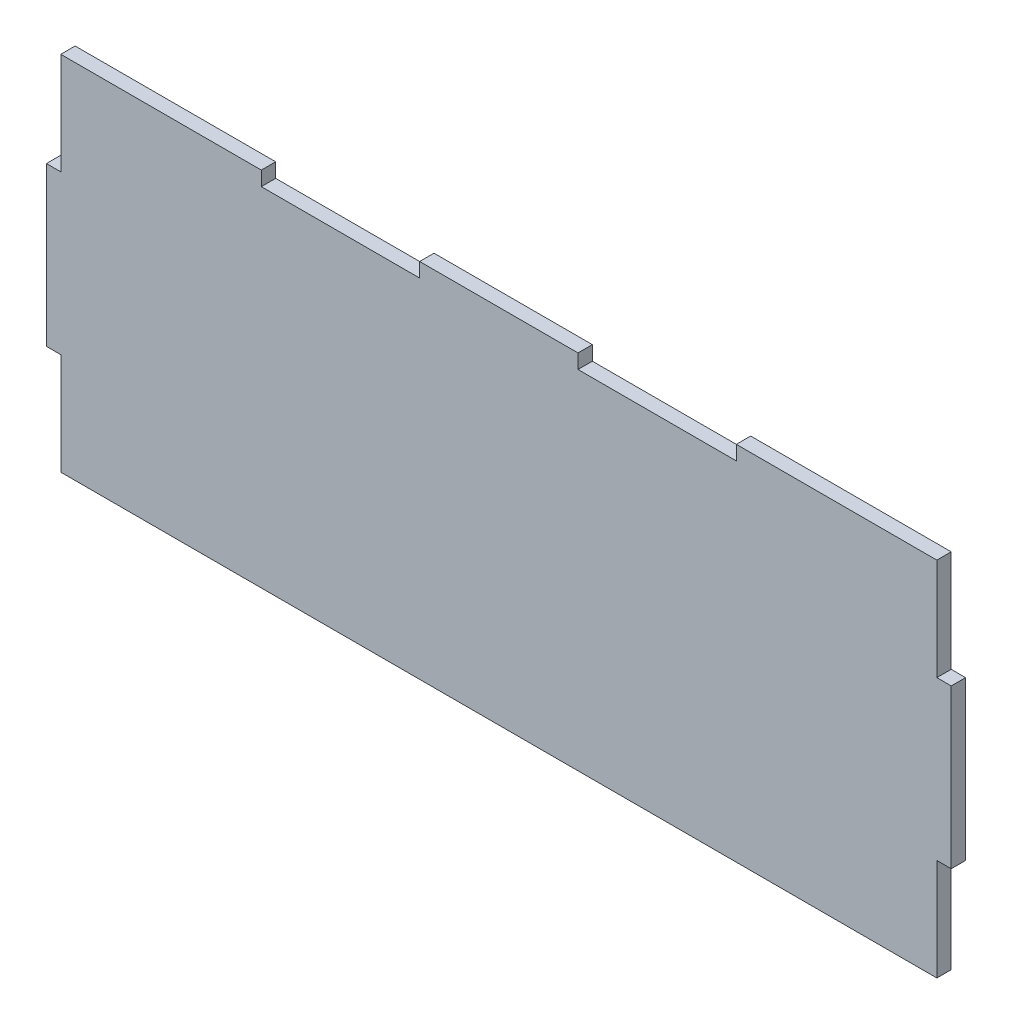
ISO-10303-21;
HEADER;
FILE_DESCRIPTION(('STEP AP214'),'2;1');
FILE_NAME('part.step','',(''),(''),'','','');
FILE_SCHEMA(('AUTOMOTIVE_DESIGN { 1 0 10303 214 1 1 1 1 }'));
ENDSEC;
DATA;
#1=APPLICATION_CONTEXT('core data for automotive mechanical design processes');
#2=APPLICATION_PROTOCOL_DEFINITION('international standard','automotive_design',2000,#1);
#3=PRODUCT_CONTEXT('',#1,'mechanical');
#4=PRODUCT('Part','Part','',(#3));
#5=PRODUCT_RELATED_PRODUCT_CATEGORY('part','',(#4));
#6=PRODUCT_DEFINITION_FORMATION('','',#4);
#7=PRODUCT_DEFINITION_CONTEXT('part definition',#1,'design');
#8=PRODUCT_DEFINITION('design','',#6,#7);
#9=PRODUCT_DEFINITION_SHAPE('','',#8);
#10=(LENGTH_UNIT() NAMED_UNIT(*) SI_UNIT(.MILLI.,.METRE.));
#11=(NAMED_UNIT(*) PLANE_ANGLE_UNIT() SI_UNIT($,.RADIAN.));
#12=(NAMED_UNIT(*) SI_UNIT($,.STERADIAN.) SOLID_ANGLE_UNIT());
#13=UNCERTAINTY_MEASURE_WITH_UNIT(LENGTH_MEASURE(1.E-05),#10,'distance_accuracy_value','');
#14=(GEOMETRIC_REPRESENTATION_CONTEXT(3) GLOBAL_UNCERTAINTY_ASSIGNED_CONTEXT((#13)) GLOBAL_UNIT_ASSIGNED_CONTEXT((#10,
#11,#12)) REPRESENTATION_CONTEXT('',''));
#15=CARTESIAN_POINT('',(0.,0.,0.));
#16=DIRECTION('',(0.,0.,1.));
#17=DIRECTION('',(1.,0.,0.));
#18=AXIS2_PLACEMENT_3D('',#15,#16,#17);
#19=CARTESIAN_POINT('',(-100.,40.,3.175));
#20=DIRECTION('',(0.,-1.,0.));
#21=DIRECTION('',(0.,0.,-1.));
#22=AXIS2_PLACEMENT_3D('',#19,#20,#21);
#23=PLANE('',#22);
#24=DIRECTION('',(0.,0.,1.));
#25=VECTOR('',#24,1.);
#26=CARTESIAN_POINT('',(96.825,40.,0.));
#27=LINE('',#26,#25);
#28=CARTESIAN_POINT('',(96.825,40.,0.));
#29=VERTEX_POINT('',#28);
#30=CARTESIAN_POINT('',(96.825,40.,3.175));
#31=VERTEX_POINT('',#30);
#32=EDGE_CURVE('E176',#29,#31,#27,.T.);
#33=ORIENTED_EDGE('',*,*,#32,.F.);
#34=DIRECTION('',(-1.,0.,0.));
#35=VECTOR('',#34,1.);
#36=CARTESIAN_POINT('',(-100.,40.,0.));
#37=LINE('',#36,#35);
#38=CARTESIAN_POINT('',(52.5,40.,0.));
#39=VERTEX_POINT('',#38);
#40=EDGE_CURVE('E40',#29,#39,#37,.T.);
#41=ORIENTED_EDGE('',*,*,#40,.T.);
#42=DIRECTION('',(0.,0.,1.));
#43=VECTOR('',#42,1.);
#44=CARTESIAN_POINT('',(52.5,40.,0.));
#45=LINE('',#44,#43);
#46=CARTESIAN_POINT('',(52.5,40.,3.175));
#47=VERTEX_POINT('',#46);
#48=EDGE_CURVE('E256',#39,#47,#45,.T.);
#49=ORIENTED_EDGE('',*,*,#48,.T.);
#50=DIRECTION('',(-1.,0.,0.));
#51=VECTOR('',#50,1.);
#52=CARTESIAN_POINT('',(-100.,40.,3.175));
#53=LINE('',#52,#51);
#54=EDGE_CURVE('E11',#31,#47,#53,.T.);
#55=ORIENTED_EDGE('',*,*,#54,.F.);
#56=EDGE_LOOP('',(#33,#41,#49,#55));
#57=FACE_BOUND('',#56,.T.);
#58=ADVANCED_FACE('F36',(#57),#23,.F.);
#59=CARTESIAN_POINT('',(-100.,-40.,3.175));
#60=DIRECTION('',(0.,1.,0.));
#61=DIRECTION('',(-1.,0.,0.));
#62=AXIS2_PLACEMENT_3D('',#59,#60,#61);
#63=PLANE('',#62);
#64=DIRECTION('',(0.,0.,1.));
#65=VECTOR('',#64,1.);
#66=CARTESIAN_POINT('',(96.825,-40.,0.));
#67=LINE('',#66,#65);
#68=CARTESIAN_POINT('',(96.825,-40.,0.));
#69=VERTEX_POINT('',#68);
#70=CARTESIAN_POINT('',(96.825,-40.,3.175));
#71=VERTEX_POINT('',#70);
#72=EDGE_CURVE('E312',#69,#71,#67,.T.);
#73=ORIENTED_EDGE('',*,*,#72,.T.);
#74=DIRECTION('',(1.,0.,0.));
#75=VECTOR('',#74,1.);
#76=CARTESIAN_POINT('',(-100.,-40.,3.175));
#77=LINE('',#76,#75);
#78=CARTESIAN_POINT('',(-96.825,-40.,3.175));
#79=VERTEX_POINT('',#78);
#80=EDGE_CURVE('E197',#79,#71,#77,.T.);
#81=ORIENTED_EDGE('',*,*,#80,.F.);
#82=DIRECTION('',(0.,0.,1.));
#83=VECTOR('',#82,1.);
#84=CARTESIAN_POINT('',(-96.825,-40.,0.));
#85=LINE('',#84,#83);
#86=CARTESIAN_POINT('',(-96.825,-40.,0.));
#87=VERTEX_POINT('',#86);
#88=EDGE_CURVE('E273',#87,#79,#85,.T.);
#89=ORIENTED_EDGE('',*,*,#88,.F.);
#90=DIRECTION('',(1.,0.,0.));
#91=VECTOR('',#90,1.);
#92=CARTESIAN_POINT('',(-100.,-40.,0.));
#93=LINE('',#92,#91);
#94=EDGE_CURVE('E207',#87,#69,#93,.T.);
#95=ORIENTED_EDGE('',*,*,#94,.T.);
#96=EDGE_LOOP('',(#73,#81,#89,#95));
#97=FACE_BOUND('',#96,.T.);
#98=ADVANCED_FACE('F345',(#97),#63,.F.);
#99=CARTESIAN_POINT('',(100.,40.,3.175));
#100=DIRECTION('',(-1.,0.,0.));
#101=DIRECTION('',(0.,0.,1.));
#102=AXIS2_PLACEMENT_3D('',#99,#100,#101);
#103=PLANE('',#102);
#104=DIRECTION('',(0.,0.,1.));
#105=VECTOR('',#104,1.);
#106=CARTESIAN_POINT('',(100.,17.5,0.));
#107=LINE('',#106,#105);
#108=CARTESIAN_POINT('',(100.,17.5,0.));
#109=VERTEX_POINT('',#108);
#110=CARTESIAN_POINT('',(100.,17.5,3.175));
#111=VERTEX_POINT('',#110);
#112=EDGE_CURVE('E288',#109,#111,#107,.T.);
#113=ORIENTED_EDGE('',*,*,#112,.T.);
#114=DIRECTION('',(0.,1.,0.));
#115=VECTOR('',#114,1.);
#116=CARTESIAN_POINT('',(100.,40.,3.175));
#117=LINE('',#116,#115);
#118=CARTESIAN_POINT('',(100.,-17.5,3.175));
#119=VERTEX_POINT('',#118);
#120=EDGE_CURVE('E219',#119,#111,#117,.T.);
#121=ORIENTED_EDGE('',*,*,#120,.F.);
#122=DIRECTION('',(0.,0.,1.));
#123=VECTOR('',#122,1.);
#124=CARTESIAN_POINT('',(100.,-17.5,0.));
#125=LINE('',#124,#123);
#126=CARTESIAN_POINT('',(100.,-17.5,0.));
#127=VERTEX_POINT('',#126);
#128=EDGE_CURVE('E308',#127,#119,#125,.T.);
#129=ORIENTED_EDGE('',*,*,#128,.F.);
#130=DIRECTION('',(0.,1.,0.));
#131=VECTOR('',#130,1.);
#132=CARTESIAN_POINT('',(100.,40.,0.));
#133=LINE('',#132,#131);
#134=EDGE_CURVE('E201',#127,#109,#133,.T.);
#135=ORIENTED_EDGE('',*,*,#134,.T.);
#136=EDGE_LOOP('',(#113,#121,#129,#135));
#137=FACE_BOUND('',#136,.T.);
#138=ADVANCED_FACE('F337',(#137),#103,.F.);
#139=CARTESIAN_POINT('',(0.,0.,3.175));
#140=DIRECTION('',(0.,0.,1.));
#141=DIRECTION('',(1.,0.,0.));
#142=AXIS2_PLACEMENT_3D('',#139,#140,#141);
#143=PLANE('',#142);
#144=ORIENTED_EDGE('',*,*,#120,.T.);
#145=DIRECTION('',(-1.,0.,0.));
#146=VECTOR('',#145,1.);
#147=CARTESIAN_POINT('',(100.,17.5,3.175));
#148=LINE('',#147,#146);
#149=CARTESIAN_POINT('',(96.825,17.5,3.175));
#150=VERTEX_POINT('',#149);
#151=EDGE_CURVE('E182',#111,#150,#148,.T.);
#152=ORIENTED_EDGE('',*,*,#151,.T.);
#153=DIRECTION('',(0.,1.,0.));
#154=VECTOR('',#153,1.);
#155=CARTESIAN_POINT('',(96.825,40.,3.175));
#156=LINE('',#155,#154);
#157=EDGE_CURVE('E315',#150,#31,#156,.T.);
#158=ORIENTED_EDGE('',*,*,#157,.T.);
#159=ORIENTED_EDGE('',*,*,#54,.T.);
#160=DIRECTION('',(0.,1.,0.));
#161=VECTOR('',#160,1.);
#162=CARTESIAN_POINT('',(52.5,40.,3.175));
#163=LINE('',#162,#161);
#164=CARTESIAN_POINT('',(52.5,36.825,3.175));
#165=VERTEX_POINT('',#164);
#166=EDGE_CURVE('E259',#165,#47,#163,.T.);
#167=ORIENTED_EDGE('',*,*,#166,.F.);
#168=DIRECTION('',(1.,0.,0.));
#169=VECTOR('',#168,1.);
#170=CARTESIAN_POINT('',(17.5,36.825,3.175));
#171=LINE('',#170,#169);
#172=CARTESIAN_POINT('',(17.5,36.825,3.175));
#173=VERTEX_POINT('',#172);
#174=EDGE_CURVE('E263',#173,#165,#171,.T.);
#175=ORIENTED_EDGE('',*,*,#174,.F.);
#176=DIRECTION('',(0.,-1.,0.));
#177=VECTOR('',#176,1.);
#178=CARTESIAN_POINT('',(17.5,40.,3.175));
#179=LINE('',#178,#177);
#180=CARTESIAN_POINT('',(17.5,40.,3.175));
#181=VERTEX_POINT('',#180);
#182=EDGE_CURVE('E234',#181,#173,#179,.T.);
#183=ORIENTED_EDGE('',*,*,#182,.F.);
#184=CARTESIAN_POINT('',(-17.5,40.,3.175));
#185=VERTEX_POINT('',#184);
#186=EDGE_CURVE('E45',#181,#185,#53,.T.);
#187=ORIENTED_EDGE('',*,*,#186,.T.);
#188=DIRECTION('',(0.,1.,0.));
#189=VECTOR('',#188,1.);
#190=CARTESIAN_POINT('',(-17.5,40.,3.175));
#191=LINE('',#190,#189);
#192=CARTESIAN_POINT('',(-17.5,36.825,3.175));
#193=VERTEX_POINT('',#192);
#194=EDGE_CURVE('E242',#193,#185,#191,.T.);
#195=ORIENTED_EDGE('',*,*,#194,.F.);
#196=DIRECTION('',(1.,0.,0.));
#197=VECTOR('',#196,1.);
#198=CARTESIAN_POINT('',(-17.5,36.825,3.175));
#199=LINE('',#198,#197);
#200=CARTESIAN_POINT('',(-52.5,36.825,3.175));
#201=VERTEX_POINT('',#200);
#202=EDGE_CURVE('E235',#201,#193,#199,.T.);
#203=ORIENTED_EDGE('',*,*,#202,.F.);
#204=DIRECTION('',(0.,-1.,0.));
#205=VECTOR('',#204,1.);
#206=CARTESIAN_POINT('',(-52.5,40.,3.175));
#207=LINE('',#206,#205);
#208=CARTESIAN_POINT('',(-52.5,40.,3.175));
#209=VERTEX_POINT('',#208);
#210=EDGE_CURVE('E239',#209,#201,#207,.T.);
#211=ORIENTED_EDGE('',*,*,#210,.F.);
#212=CARTESIAN_POINT('',(-96.825,40.,3.175));
#213=VERTEX_POINT('',#212);
#214=EDGE_CURVE('E47',#209,#213,#53,.T.);
#215=ORIENTED_EDGE('',*,*,#214,.T.);
#216=DIRECTION('',(0.,1.,0.));
#217=VECTOR('',#216,1.);
#218=CARTESIAN_POINT('',(-96.825,40.,3.175));
#219=LINE('',#218,#217);
#220=CARTESIAN_POINT('',(-96.825,17.5,3.175));
#221=VERTEX_POINT('',#220);
#222=EDGE_CURVE('E299',#221,#213,#219,.T.);
#223=ORIENTED_EDGE('',*,*,#222,.F.);
#224=DIRECTION('',(1.,0.,0.));
#225=VECTOR('',#224,1.);
#226=CARTESIAN_POINT('',(-100.,17.5,3.175));
#227=LINE('',#226,#225);
#228=CARTESIAN_POINT('',(-100.,17.5,3.175));
#229=VERTEX_POINT('',#228);
#230=EDGE_CURVE('E281',#229,#221,#227,.T.);
#231=ORIENTED_EDGE('',*,*,#230,.F.);
#232=DIRECTION('',(0.,-1.,0.));
#233=VECTOR('',#232,1.);
#234=CARTESIAN_POINT('',(-100.,40.,3.175));
#235=LINE('',#234,#233);
#236=CARTESIAN_POINT('',(-100.,-17.5,3.175));
#237=VERTEX_POINT('',#236);
#238=EDGE_CURVE('E193',#229,#237,#235,.T.);
#239=ORIENTED_EDGE('',*,*,#238,.T.);
#240=DIRECTION('',(-1.,0.,0.));
#241=VECTOR('',#240,1.);
#242=CARTESIAN_POINT('',(-100.,-17.5,3.175));
#243=LINE('',#242,#241);
#244=CARTESIAN_POINT('',(-96.825,-17.5,3.175));
#245=VERTEX_POINT('',#244);
#246=EDGE_CURVE('E282',#245,#237,#243,.T.);
#247=ORIENTED_EDGE('',*,*,#246,.F.);
#248=DIRECTION('',(0.,1.,0.));
#249=VECTOR('',#248,1.);
#250=CARTESIAN_POINT('',(-96.825,-40.,3.175));
#251=LINE('',#250,#249);
#252=EDGE_CURVE('E285',#79,#245,#251,.T.);
#253=ORIENTED_EDGE('',*,*,#252,.F.);
#254=ORIENTED_EDGE('',*,*,#80,.T.);
#255=DIRECTION('',(0.,1.,0.));
#256=VECTOR('',#255,1.);
#257=CARTESIAN_POINT('',(96.825,-40.,3.175));
#258=LINE('',#257,#256);
#259=CARTESIAN_POINT('',(96.825,-17.5,3.175));
#260=VERTEX_POINT('',#259);
#261=EDGE_CURVE('E316',#71,#260,#258,.T.);
#262=ORIENTED_EDGE('',*,*,#261,.T.);
#263=DIRECTION('',(1.,0.,0.));
#264=VECTOR('',#263,1.);
#265=CARTESIAN_POINT('',(100.,-17.5,3.175));
#266=LINE('',#265,#264);
#267=EDGE_CURVE('E320',#260,#119,#266,.T.);
#268=ORIENTED_EDGE('',*,*,#267,.T.);
#269=EDGE_LOOP('',(#144,#152,#158,#159,#167,#175,#183,#187,#195,#203,#211,#215,#223,#231,#239,
#247,#253,#254,#262,#268));
#270=FACE_BOUND('',#269,.T.);
#271=ADVANCED_FACE('F339',(#270),#143,.T.);
#272=CARTESIAN_POINT('',(0.,0.,0.));
#273=DIRECTION('',(0.,0.,1.));
#274=DIRECTION('',(1.,0.,0.));
#275=AXIS2_PLACEMENT_3D('',#272,#273,#274);
#276=PLANE('',#275);
#277=DIRECTION('',(-1.,0.,0.));
#278=VECTOR('',#277,1.);
#279=CARTESIAN_POINT('',(100.,17.5,0.));
#280=LINE('',#279,#278);
#281=CARTESIAN_POINT('',(96.825,17.5,0.));
#282=VERTEX_POINT('',#281);
#283=EDGE_CURVE('E181',#109,#282,#280,.T.);
#284=ORIENTED_EDGE('',*,*,#283,.F.);
#285=ORIENTED_EDGE('',*,*,#134,.F.);
#286=DIRECTION('',(1.,0.,0.));
#287=VECTOR('',#286,1.);
#288=CARTESIAN_POINT('',(100.,-17.5,0.));
#289=LINE('',#288,#287);
#290=CARTESIAN_POINT('',(96.825,-17.5,0.));
#291=VERTEX_POINT('',#290);
#292=EDGE_CURVE('E319',#291,#127,#289,.T.);
#293=ORIENTED_EDGE('',*,*,#292,.F.);
#294=DIRECTION('',(0.,1.,0.));
#295=VECTOR('',#294,1.);
#296=CARTESIAN_POINT('',(96.825,-40.,0.));
#297=LINE('',#296,#295);
#298=EDGE_CURVE('E310',#69,#291,#297,.T.);
#299=ORIENTED_EDGE('',*,*,#298,.F.);
#300=ORIENTED_EDGE('',*,*,#94,.F.);
#301=DIRECTION('',(0.,1.,0.));
#302=VECTOR('',#301,1.);
#303=CARTESIAN_POINT('',(-96.825,-40.,0.));
#304=LINE('',#303,#302);
#305=CARTESIAN_POINT('',(-96.825,-17.5,0.));
#306=VERTEX_POINT('',#305);
#307=EDGE_CURVE('E284',#87,#306,#304,.T.);
#308=ORIENTED_EDGE('',*,*,#307,.T.);
#309=DIRECTION('',(-1.,0.,0.));
#310=VECTOR('',#309,1.);
#311=CARTESIAN_POINT('',(-100.,-17.5,0.));
#312=LINE('',#311,#310);
#313=CARTESIAN_POINT('',(-100.,-17.5,0.));
#314=VERTEX_POINT('',#313);
#315=EDGE_CURVE('E276',#306,#314,#312,.T.);
#316=ORIENTED_EDGE('',*,*,#315,.T.);
#317=DIRECTION('',(0.,-1.,0.));
#318=VECTOR('',#317,1.);
#319=CARTESIAN_POINT('',(-100.,40.,0.));
#320=LINE('',#319,#318);
#321=CARTESIAN_POINT('',(-100.,17.5,0.));
#322=VERTEX_POINT('',#321);
#323=EDGE_CURVE('E213',#322,#314,#320,.T.);
#324=ORIENTED_EDGE('',*,*,#323,.F.);
#325=DIRECTION('',(1.,0.,0.));
#326=VECTOR('',#325,1.);
#327=CARTESIAN_POINT('',(-100.,17.5,0.));
#328=LINE('',#327,#326);
#329=CARTESIAN_POINT('',(-96.825,17.5,0.));
#330=VERTEX_POINT('',#329);
#331=EDGE_CURVE('E301',#322,#330,#328,.T.);
#332=ORIENTED_EDGE('',*,*,#331,.T.);
#333=DIRECTION('',(0.,1.,0.));
#334=VECTOR('',#333,1.);
#335=CARTESIAN_POINT('',(-96.825,40.,0.));
#336=LINE('',#335,#334);
#337=CARTESIAN_POINT('',(-96.825,40.,0.));
#338=VERTEX_POINT('',#337);
#339=EDGE_CURVE('E296',#330,#338,#336,.T.);
#340=ORIENTED_EDGE('',*,*,#339,.T.);
#341=CARTESIAN_POINT('',(-52.5,40.,0.));
#342=VERTEX_POINT('',#341);
#343=EDGE_CURVE('E195',#342,#338,#37,.T.);
#344=ORIENTED_EDGE('',*,*,#343,.F.);
#345=DIRECTION('',(0.,-1.,0.));
#346=VECTOR('',#345,1.);
#347=CARTESIAN_POINT('',(-52.5,40.,0.));
#348=LINE('',#347,#346);
#349=CARTESIAN_POINT('',(-52.5,36.825,0.));
#350=VERTEX_POINT('',#349);
#351=EDGE_CURVE('E247',#342,#350,#348,.T.);
#352=ORIENTED_EDGE('',*,*,#351,.T.);
#353=DIRECTION('',(1.,0.,0.));
#354=VECTOR('',#353,1.);
#355=CARTESIAN_POINT('',(-17.5,36.825,0.));
#356=LINE('',#355,#354);
#357=CARTESIAN_POINT('',(-17.5,36.825,0.));
#358=VERTEX_POINT('',#357);
#359=EDGE_CURVE('E228',#350,#358,#356,.T.);
#360=ORIENTED_EDGE('',*,*,#359,.T.);
#361=DIRECTION('',(0.,1.,0.));
#362=VECTOR('',#361,1.);
#363=CARTESIAN_POINT('',(-17.5,40.,0.));
#364=LINE('',#363,#362);
#365=CARTESIAN_POINT('',(-17.5,40.,0.));
#366=VERTEX_POINT('',#365);
#367=EDGE_CURVE('E238',#358,#366,#364,.T.);
#368=ORIENTED_EDGE('',*,*,#367,.T.);
#369=CARTESIAN_POINT('',(17.5,40.,0.));
#370=VERTEX_POINT('',#369);
#371=EDGE_CURVE('E194',#370,#366,#37,.T.);
#372=ORIENTED_EDGE('',*,*,#371,.F.);
#373=DIRECTION('',(0.,-1.,0.));
#374=VECTOR('',#373,1.);
#375=CARTESIAN_POINT('',(17.5,40.,0.));
#376=LINE('',#375,#374);
#377=CARTESIAN_POINT('',(17.5,36.825,0.));
#378=VERTEX_POINT('',#377);
#379=EDGE_CURVE('E262',#370,#378,#376,.T.);
#380=ORIENTED_EDGE('',*,*,#379,.T.);
#381=DIRECTION('',(1.,0.,0.));
#382=VECTOR('',#381,1.);
#383=CARTESIAN_POINT('',(17.5,36.825,0.));
#384=LINE('',#383,#382);
#385=CARTESIAN_POINT('',(52.5,36.825,0.));
#386=VERTEX_POINT('',#385);
#387=EDGE_CURVE('E269',#378,#386,#384,.T.);
#388=ORIENTED_EDGE('',*,*,#387,.T.);
#389=DIRECTION('',(0.,1.,0.));
#390=VECTOR('',#389,1.);
#391=CARTESIAN_POINT('',(52.5,40.,0.));
#392=LINE('',#391,#390);
#393=EDGE_CURVE('E192',#386,#39,#392,.T.);
#394=ORIENTED_EDGE('',*,*,#393,.T.);
#395=ORIENTED_EDGE('',*,*,#40,.F.);
#396=DIRECTION('',(0.,1.,0.));
#397=VECTOR('',#396,1.);
#398=CARTESIAN_POINT('',(96.825,40.,0.));
#399=LINE('',#398,#397);
#400=EDGE_CURVE('E173',#282,#29,#399,.T.);
#401=ORIENTED_EDGE('',*,*,#400,.F.);
#402=EDGE_LOOP('',(#284,#285,#293,#299,#300,#308,#316,#324,#332,#340,#344,#352,#360,#368,#372,
#380,#388,#394,#395,#401));
#403=FACE_BOUND('',#402,.T.);
#404=ADVANCED_FACE('F190',(#403),#276,.F.);
#405=ORIENTED_EDGE('',*,*,#186,.F.);
#406=DIRECTION('',(0.,0.,1.));
#407=VECTOR('',#406,1.);
#408=CARTESIAN_POINT('',(17.5,40.,0.));
#409=LINE('',#408,#407);
#410=EDGE_CURVE('E217',#370,#181,#409,.T.);
#411=ORIENTED_EDGE('',*,*,#410,.F.);
#412=ORIENTED_EDGE('',*,*,#371,.T.);
#413=DIRECTION('',(0.,0.,1.));
#414=VECTOR('',#413,1.);
#415=CARTESIAN_POINT('',(-17.5,40.,0.));
#416=LINE('',#415,#414);
#417=EDGE_CURVE('E224',#366,#185,#416,.T.);
#418=ORIENTED_EDGE('',*,*,#417,.T.);
#419=EDGE_LOOP('',(#405,#411,#412,#418));
#420=FACE_BOUND('',#419,.T.);
#421=ADVANCED_FACE('F376',(#420),#23,.F.);
#422=CARTESIAN_POINT('',(-100.,40.,3.175));
#423=DIRECTION('',(1.,0.,0.));
#424=DIRECTION('',(0.,0.,-1.));
#425=AXIS2_PLACEMENT_3D('',#422,#423,#424);
#426=PLANE('',#425);
#427=ORIENTED_EDGE('',*,*,#238,.F.);
#428=DIRECTION('',(0.,0.,1.));
#429=VECTOR('',#428,1.);
#430=CARTESIAN_POINT('',(-100.,17.5,0.));
#431=LINE('',#430,#429);
#432=EDGE_CURVE('E293',#322,#229,#431,.T.);
#433=ORIENTED_EDGE('',*,*,#432,.F.);
#434=ORIENTED_EDGE('',*,*,#323,.T.);
#435=DIRECTION('',(0.,0.,1.));
#436=VECTOR('',#435,1.);
#437=CARTESIAN_POINT('',(-100.,-17.5,0.));
#438=LINE('',#437,#436);
#439=EDGE_CURVE('E278',#314,#237,#438,.T.);
#440=ORIENTED_EDGE('',*,*,#439,.T.);
#441=EDGE_LOOP('',(#427,#433,#434,#440));
#442=FACE_BOUND('',#441,.T.);
#443=ADVANCED_FACE('F38',(#442),#426,.F.);
#444=ORIENTED_EDGE('',*,*,#343,.T.);
#445=DIRECTION('',(0.,0.,1.));
#446=VECTOR('',#445,1.);
#447=CARTESIAN_POINT('',(-96.825,40.,0.));
#448=LINE('',#447,#446);
#449=EDGE_CURVE('E244',#338,#213,#448,.T.);
#450=ORIENTED_EDGE('',*,*,#449,.T.);
#451=ORIENTED_EDGE('',*,*,#214,.F.);
#452=DIRECTION('',(0.,0.,1.));
#453=VECTOR('',#452,1.);
#454=CARTESIAN_POINT('',(-52.5,40.,0.));
#455=LINE('',#454,#453);
#456=EDGE_CURVE('E227',#342,#209,#455,.T.);
#457=ORIENTED_EDGE('',*,*,#456,.F.);
#458=EDGE_LOOP('',(#444,#450,#451,#457));
#459=FACE_BOUND('',#458,.T.);
#460=ADVANCED_FACE('F366',(#459),#23,.F.);
#461=CARTESIAN_POINT('',(-17.5,40.,0.));
#462=DIRECTION('',(1.,0.,0.));
#463=DIRECTION('',(0.,1.,0.));
#464=AXIS2_PLACEMENT_3D('',#461,#462,#463);
#465=PLANE('',#464);
#466=ORIENTED_EDGE('',*,*,#194,.T.);
#467=ORIENTED_EDGE('',*,*,#417,.F.);
#468=ORIENTED_EDGE('',*,*,#367,.F.);
#469=DIRECTION('',(0.,0.,1.));
#470=VECTOR('',#469,1.);
#471=CARTESIAN_POINT('',(-17.5,36.825,0.));
#472=LINE('',#471,#470);
#473=EDGE_CURVE('E232',#358,#193,#472,.T.);
#474=ORIENTED_EDGE('',*,*,#473,.T.);
#475=EDGE_LOOP('',(#466,#467,#468,#474));
#476=FACE_BOUND('',#475,.T.);
#477=ADVANCED_FACE('F380',(#476),#465,.F.);
#478=CARTESIAN_POINT('',(-17.5,36.825,0.));
#479=DIRECTION('',(0.,-1.,0.));
#480=DIRECTION('',(0.,0.,-1.));
#481=AXIS2_PLACEMENT_3D('',#478,#479,#480);
#482=PLANE('',#481);
#483=ORIENTED_EDGE('',*,*,#202,.T.);
#484=ORIENTED_EDGE('',*,*,#473,.F.);
#485=ORIENTED_EDGE('',*,*,#359,.F.);
#486=DIRECTION('',(0.,0.,1.));
#487=VECTOR('',#486,1.);
#488=CARTESIAN_POINT('',(-52.5,36.825,0.));
#489=LINE('',#488,#487);
#490=EDGE_CURVE('E230',#350,#201,#489,.T.);
#491=ORIENTED_EDGE('',*,*,#490,.T.);
#492=EDGE_LOOP('',(#483,#484,#485,#491));
#493=FACE_BOUND('',#492,.T.);
#494=ADVANCED_FACE('F383',(#493),#482,.F.);
#495=CARTESIAN_POINT('',(-52.5,40.,0.));
#496=DIRECTION('',(-1.,0.,0.));
#497=DIRECTION('',(0.,-1.,0.));
#498=AXIS2_PLACEMENT_3D('',#495,#496,#497);
#499=PLANE('',#498);
#500=ORIENTED_EDGE('',*,*,#210,.T.);
#501=ORIENTED_EDGE('',*,*,#490,.F.);
#502=ORIENTED_EDGE('',*,*,#351,.F.);
#503=ORIENTED_EDGE('',*,*,#456,.T.);
#504=EDGE_LOOP('',(#500,#501,#502,#503));
#505=FACE_BOUND('',#504,.T.);
#506=ADVANCED_FACE('F385',(#505),#499,.F.);
#507=CARTESIAN_POINT('',(17.5,40.,0.));
#508=DIRECTION('',(-1.,0.,0.));
#509=DIRECTION('',(0.,-1.,0.));
#510=AXIS2_PLACEMENT_3D('',#507,#508,#509);
#511=PLANE('',#510);
#512=ORIENTED_EDGE('',*,*,#182,.T.);
#513=DIRECTION('',(0.,0.,1.));
#514=VECTOR('',#513,1.);
#515=CARTESIAN_POINT('',(17.5,36.825,0.));
#516=LINE('',#515,#514);
#517=EDGE_CURVE('E252',#378,#173,#516,.T.);
#518=ORIENTED_EDGE('',*,*,#517,.F.);
#519=ORIENTED_EDGE('',*,*,#379,.F.);
#520=ORIENTED_EDGE('',*,*,#410,.T.);
#521=EDGE_LOOP('',(#512,#518,#519,#520));
#522=FACE_BOUND('',#521,.T.);
#523=ADVANCED_FACE('F387',(#522),#511,.F.);
#524=CARTESIAN_POINT('',(52.5,40.,0.));
#525=DIRECTION('',(1.,0.,0.));
#526=DIRECTION('',(0.,0.,-1.));
#527=AXIS2_PLACEMENT_3D('',#524,#525,#526);
#528=PLANE('',#527);
#529=ORIENTED_EDGE('',*,*,#166,.T.);
#530=ORIENTED_EDGE('',*,*,#48,.F.);
#531=ORIENTED_EDGE('',*,*,#393,.F.);
#532=DIRECTION('',(0.,0.,1.));
#533=VECTOR('',#532,1.);
#534=CARTESIAN_POINT('',(52.5,36.825,0.));
#535=LINE('',#534,#533);
#536=EDGE_CURVE('E254',#386,#165,#535,.T.);
#537=ORIENTED_EDGE('',*,*,#536,.T.);
#538=EDGE_LOOP('',(#529,#530,#531,#537));
#539=FACE_BOUND('',#538,.T.);
#540=ADVANCED_FACE('F393',(#539),#528,.F.);
#541=CARTESIAN_POINT('',(17.5,36.825,0.));
#542=DIRECTION('',(0.,-1.,0.));
#543=DIRECTION('',(0.,0.,-1.));
#544=AXIS2_PLACEMENT_3D('',#541,#542,#543);
#545=PLANE('',#544);
#546=ORIENTED_EDGE('',*,*,#174,.T.);
#547=ORIENTED_EDGE('',*,*,#536,.F.);
#548=ORIENTED_EDGE('',*,*,#387,.F.);
#549=ORIENTED_EDGE('',*,*,#517,.T.);
#550=EDGE_LOOP('',(#546,#547,#548,#549));
#551=FACE_BOUND('',#550,.T.);
#552=ADVANCED_FACE('F478',(#551),#545,.F.);
#553=CARTESIAN_POINT('',(-100.,-17.5,0.));
#554=DIRECTION('',(0.,1.,0.));
#555=DIRECTION('',(0.,0.,1.));
#556=AXIS2_PLACEMENT_3D('',#553,#554,#555);
#557=PLANE('',#556);
#558=ORIENTED_EDGE('',*,*,#246,.T.);
#559=ORIENTED_EDGE('',*,*,#439,.F.);
#560=ORIENTED_EDGE('',*,*,#315,.F.);
#561=DIRECTION('',(0.,0.,1.));
#562=VECTOR('',#561,1.);
#563=CARTESIAN_POINT('',(-96.825,-17.5,0.));
#564=LINE('',#563,#562);
#565=EDGE_CURVE('E275',#306,#245,#564,.T.);
#566=ORIENTED_EDGE('',*,*,#565,.T.);
#567=EDGE_LOOP('',(#558,#559,#560,#566));
#568=FACE_BOUND('',#567,.T.);
#569=ADVANCED_FACE('F353',(#568),#557,.F.);
#570=CARTESIAN_POINT('',(-96.825,-40.,0.));
#571=DIRECTION('',(1.,0.,0.));
#572=DIRECTION('',(0.,0.,-1.));
#573=AXIS2_PLACEMENT_3D('',#570,#571,#572);
#574=PLANE('',#573);
#575=ORIENTED_EDGE('',*,*,#252,.T.);
#576=ORIENTED_EDGE('',*,*,#565,.F.);
#577=ORIENTED_EDGE('',*,*,#307,.F.);
#578=ORIENTED_EDGE('',*,*,#88,.T.);
#579=EDGE_LOOP('',(#575,#576,#577,#578));
#580=FACE_BOUND('',#579,.T.);
#581=ADVANCED_FACE('F350',(#580),#574,.F.);
#582=CARTESIAN_POINT('',(-96.825,40.,0.));
#583=DIRECTION('',(1.,0.,0.));
#584=DIRECTION('',(0.,0.,-1.));
#585=AXIS2_PLACEMENT_3D('',#582,#583,#584);
#586=PLANE('',#585);
#587=ORIENTED_EDGE('',*,*,#222,.T.);
#588=ORIENTED_EDGE('',*,*,#449,.F.);
#589=ORIENTED_EDGE('',*,*,#339,.F.);
#590=DIRECTION('',(0.,0.,1.));
#591=VECTOR('',#590,1.);
#592=CARTESIAN_POINT('',(-96.825,17.5,0.));
#593=LINE('',#592,#591);
#594=EDGE_CURVE('E295',#330,#221,#593,.T.);
#595=ORIENTED_EDGE('',*,*,#594,.T.);
#596=EDGE_LOOP('',(#587,#588,#589,#595));
#597=FACE_BOUND('',#596,.T.);
#598=ADVANCED_FACE('F364',(#597),#586,.F.);
#599=CARTESIAN_POINT('',(-100.,17.5,0.));
#600=DIRECTION('',(0.,-1.,0.));
#601=DIRECTION('',(0.,0.,-1.));
#602=AXIS2_PLACEMENT_3D('',#599,#600,#601);
#603=PLANE('',#602);
#604=ORIENTED_EDGE('',*,*,#230,.T.);
#605=ORIENTED_EDGE('',*,*,#594,.F.);
#606=ORIENTED_EDGE('',*,*,#331,.F.);
#607=ORIENTED_EDGE('',*,*,#432,.T.);
#608=EDGE_LOOP('',(#604,#605,#606,#607));
#609=FACE_BOUND('',#608,.T.);
#610=ADVANCED_FACE('F362',(#609),#603,.F.);
#611=CARTESIAN_POINT('',(96.825,-40.,0.));
#612=DIRECTION('',(1.,0.,0.));
#613=DIRECTION('',(0.,0.,-1.));
#614=AXIS2_PLACEMENT_3D('',#611,#612,#613);
#615=PLANE('',#614);
#616=ORIENTED_EDGE('',*,*,#261,.F.);
#617=ORIENTED_EDGE('',*,*,#72,.F.);
#618=ORIENTED_EDGE('',*,*,#298,.T.);
#619=DIRECTION('',(0.,0.,1.));
#620=VECTOR('',#619,1.);
#621=CARTESIAN_POINT('',(96.825,-17.5,0.));
#622=LINE('',#621,#620);
#623=EDGE_CURVE('E62',#291,#260,#622,.T.);
#624=ORIENTED_EDGE('',*,*,#623,.T.);
#625=EDGE_LOOP('',(#616,#617,#618,#624));
#626=FACE_BOUND('',#625,.T.);
#627=ADVANCED_FACE('F343',(#626),#615,.T.);
#628=CARTESIAN_POINT('',(100.,-17.5,0.));
#629=DIRECTION('',(0.,-1.,0.));
#630=DIRECTION('',(0.,0.,-1.));
#631=AXIS2_PLACEMENT_3D('',#628,#629,#630);
#632=PLANE('',#631);
#633=ORIENTED_EDGE('',*,*,#267,.F.);
#634=ORIENTED_EDGE('',*,*,#623,.F.);
#635=ORIENTED_EDGE('',*,*,#292,.T.);
#636=ORIENTED_EDGE('',*,*,#128,.T.);
#637=EDGE_LOOP('',(#633,#634,#635,#636));
#638=FACE_BOUND('',#637,.T.);
#639=ADVANCED_FACE('F335',(#638),#632,.T.);
#640=CARTESIAN_POINT('',(100.,17.5,0.));
#641=DIRECTION('',(0.,1.,0.));
#642=DIRECTION('',(0.,0.,1.));
#643=AXIS2_PLACEMENT_3D('',#640,#641,#642);
#644=PLANE('',#643);
#645=ORIENTED_EDGE('',*,*,#151,.F.);
#646=ORIENTED_EDGE('',*,*,#112,.F.);
#647=ORIENTED_EDGE('',*,*,#283,.T.);
#648=DIRECTION('',(0.,0.,1.));
#649=VECTOR('',#648,1.);
#650=CARTESIAN_POINT('',(96.825,17.5,0.));
#651=LINE('',#650,#649);
#652=EDGE_CURVE('E54',#282,#150,#651,.T.);
#653=ORIENTED_EDGE('',*,*,#652,.T.);
#654=EDGE_LOOP('',(#645,#646,#647,#653));
#655=FACE_BOUND('',#654,.T.);
#656=ADVANCED_FACE('F331',(#655),#644,.T.);
#657=CARTESIAN_POINT('',(96.825,40.,0.));
#658=DIRECTION('',(1.,0.,0.));
#659=DIRECTION('',(0.,0.,-1.));
#660=AXIS2_PLACEMENT_3D('',#657,#658,#659);
#661=PLANE('',#660);
#662=ORIENTED_EDGE('',*,*,#157,.F.);
#663=ORIENTED_EDGE('',*,*,#652,.F.);
#664=ORIENTED_EDGE('',*,*,#400,.T.);
#665=ORIENTED_EDGE('',*,*,#32,.T.);
#666=EDGE_LOOP('',(#662,#663,#664,#665));
#667=FACE_BOUND('',#666,.T.);
#668=ADVANCED_FACE('F175',(#667),#661,.T.);
#669=CLOSED_SHELL('',(#58,#98,#138,#271,#404,#421,#443,#460,#477,#494,#506,#523,#540,#552,#569,
#581,#598,#610,#627,#639,#656,#668));
#670=MANIFOLD_SOLID_BREP('B2',#669);
#671=ADVANCED_BREP_SHAPE_REPRESENTATION('',(#18,#670),#14);
#672=SHAPE_DEFINITION_REPRESENTATION(#9,#671);
ENDSEC;
END-ISO-10303-21;
